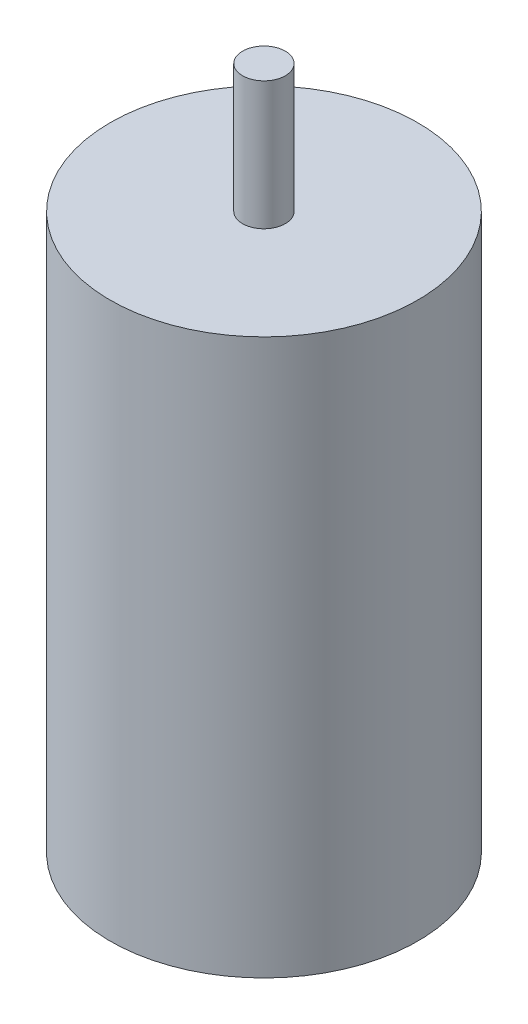
ISO-10303-21;
HEADER;
FILE_DESCRIPTION(('STEP AP214'),'2;1');
FILE_NAME('part.step','',(''),(''),'','','');
FILE_SCHEMA(('AUTOMOTIVE_DESIGN { 1 0 10303 214 1 1 1 1 }'));
ENDSEC;
DATA;
#1=APPLICATION_CONTEXT('core data for automotive mechanical design processes');
#2=APPLICATION_PROTOCOL_DEFINITION('international standard','automotive_design',2000,#1);
#3=PRODUCT_CONTEXT('',#1,'mechanical');
#4=PRODUCT('Part','Part','',(#3));
#5=PRODUCT_RELATED_PRODUCT_CATEGORY('part','',(#4));
#6=PRODUCT_DEFINITION_FORMATION('','',#4);
#7=PRODUCT_DEFINITION_CONTEXT('part definition',#1,'design');
#8=PRODUCT_DEFINITION('design','',#6,#7);
#9=PRODUCT_DEFINITION_SHAPE('','',#8);
#10=(LENGTH_UNIT() NAMED_UNIT(*) SI_UNIT(.MILLI.,.METRE.));
#11=(NAMED_UNIT(*) PLANE_ANGLE_UNIT() SI_UNIT($,.RADIAN.));
#12=(NAMED_UNIT(*) SI_UNIT($,.STERADIAN.) SOLID_ANGLE_UNIT());
#13=UNCERTAINTY_MEASURE_WITH_UNIT(LENGTH_MEASURE(1.E-05),#10,'distance_accuracy_value','');
#14=(GEOMETRIC_REPRESENTATION_CONTEXT(3) GLOBAL_UNCERTAINTY_ASSIGNED_CONTEXT((#13)) GLOBAL_UNIT_ASSIGNED_CONTEXT((#10,
#11,#12)) REPRESENTATION_CONTEXT('',''));
#15=CARTESIAN_POINT('',(0.,0.,0.));
#16=DIRECTION('',(0.,0.,1.));
#17=DIRECTION('',(1.,0.,0.));
#18=AXIS2_PLACEMENT_3D('',#15,#16,#17);
#19=CARTESIAN_POINT('',(0.,32.5,0.));
#20=DIRECTION('',(0.,1.,0.));
#21=DIRECTION('',(1.,0.,0.));
#22=AXIS2_PLACEMENT_3D('',#19,#20,#21);
#23=PLANE('',#22);
#24=CARTESIAN_POINT('',(0.,32.5,0.));
#25=DIRECTION('',(0.,-1.,0.));
#26=DIRECTION('',(-1.,0.,0.));
#27=AXIS2_PLACEMENT_3D('',#24,#25,#26);
#28=CIRCLE('',#27,2.5);
#29=CARTESIAN_POINT('',(2.5,32.5,0.));
#30=VERTEX_POINT('',#29);
#31=EDGE_CURVE('E56',#30,#30,#28,.T.);
#32=ORIENTED_EDGE('',*,*,#31,.T.);
#33=EDGE_LOOP('',(#32));
#34=FACE_BOUND('',#33,.T.);
#35=CARTESIAN_POINT('',(0.,32.5,0.));
#36=DIRECTION('',(0.,1.,0.));
#37=DIRECTION('',(1.,0.,0.));
#38=AXIS2_PLACEMENT_3D('',#35,#36,#37);
#39=CIRCLE('',#38,18.);
#40=CARTESIAN_POINT('',(-18.,32.5,0.));
#41=VERTEX_POINT('',#40);
#42=EDGE_CURVE('E27',#41,#41,#39,.T.);
#43=ORIENTED_EDGE('',*,*,#42,.T.);
#44=EDGE_LOOP('',(#43));
#45=FACE_BOUND('',#44,.T.);
#46=ADVANCED_FACE('F16',(#34,#45),#23,.T.);
#47=CARTESIAN_POINT('',(0.,0.,0.));
#48=DIRECTION('',(0.,1.,0.));
#49=DIRECTION('',(1.,0.,0.));
#50=AXIS2_PLACEMENT_3D('',#47,#48,#49);
#51=CYLINDRICAL_SURFACE('',#50,18.);
#52=ORIENTED_EDGE('',*,*,#42,.F.);
#53=DIRECTION('',(0.,-1.,0.));
#54=VECTOR('',#53,1.);
#55=CARTESIAN_POINT('',(-18.,0.,0.));
#56=LINE('',#55,#54);
#57=CARTESIAN_POINT('',(-18.,-32.5,0.));
#58=VERTEX_POINT('',#57);
#59=EDGE_CURVE('E11',#41,#58,#56,.T.);
#60=ORIENTED_EDGE('',*,*,#59,.T.);
#61=CARTESIAN_POINT('',(0.,-32.5,0.));
#62=DIRECTION('',(0.,-1.,0.));
#63=DIRECTION('',(1.,0.,0.));
#64=AXIS2_PLACEMENT_3D('',#61,#62,#63);
#65=CIRCLE('',#64,18.);
#66=EDGE_CURVE('E59',#58,#58,#65,.T.);
#67=ORIENTED_EDGE('',*,*,#66,.F.);
#68=ORIENTED_EDGE('',*,*,#59,.F.);
#69=EDGE_LOOP('',(#52,#60,#67,#68));
#70=FACE_BOUND('',#69,.T.);
#71=ADVANCED_FACE('F71',(#70),#51,.T.);
#72=CARTESIAN_POINT('',(0.,-32.5,0.));
#73=DIRECTION('',(0.,1.,0.));
#74=DIRECTION('',(1.,0.,0.));
#75=AXIS2_PLACEMENT_3D('',#72,#73,#74);
#76=PLANE('',#75);
#77=ORIENTED_EDGE('',*,*,#66,.T.);
#78=EDGE_LOOP('',(#77));
#79=FACE_BOUND('',#78,.T.);
#80=ADVANCED_FACE('F73',(#79),#76,.F.);
#81=CARTESIAN_POINT('',(0.,47.5,0.));
#82=DIRECTION('',(0.,1.,0.));
#83=DIRECTION('',(1.,0.,0.));
#84=AXIS2_PLACEMENT_3D('',#81,#82,#83);
#85=PLANE('',#84);
#86=CARTESIAN_POINT('',(0.,47.5,0.));
#87=DIRECTION('',(0.,1.,0.));
#88=DIRECTION('',(-1.,0.,0.));
#89=AXIS2_PLACEMENT_3D('',#86,#87,#88);
#90=CIRCLE('',#89,2.5);
#91=CARTESIAN_POINT('',(2.5,47.5,0.));
#92=VERTEX_POINT('',#91);
#93=EDGE_CURVE('E20',#92,#92,#90,.T.);
#94=ORIENTED_EDGE('',*,*,#93,.T.);
#95=EDGE_LOOP('',(#94));
#96=FACE_BOUND('',#95,.T.);
#97=ADVANCED_FACE('F75',(#96),#85,.T.);
#98=CARTESIAN_POINT('',(0.,32.5,0.));
#99=DIRECTION('',(0.,1.,0.));
#100=DIRECTION('',(-1.,0.,0.));
#101=AXIS2_PLACEMENT_3D('',#98,#99,#100);
#102=CYLINDRICAL_SURFACE('',#101,2.5);
#103=ORIENTED_EDGE('',*,*,#93,.F.);
#104=DIRECTION('',(0.,-1.,0.));
#105=VECTOR('',#104,1.);
#106=CARTESIAN_POINT('',(2.5,32.5,0.));
#107=LINE('',#106,#105);
#108=EDGE_CURVE('E50',#92,#30,#107,.T.);
#109=ORIENTED_EDGE('',*,*,#108,.T.);
#110=ORIENTED_EDGE('',*,*,#31,.F.);
#111=ORIENTED_EDGE('',*,*,#108,.F.);
#112=EDGE_LOOP('',(#103,#109,#110,#111));
#113=FACE_BOUND('',#112,.T.);
#114=ADVANCED_FACE('F18',(#113),#102,.T.);
#115=CLOSED_SHELL('',(#46,#71,#80,#97,#114));
#116=MANIFOLD_SOLID_BREP('B1',#115);
#117=ADVANCED_BREP_SHAPE_REPRESENTATION('',(#18,#116),#14);
#118=SHAPE_DEFINITION_REPRESENTATION(#9,#117);
ENDSEC;
END-ISO-10303-21;
